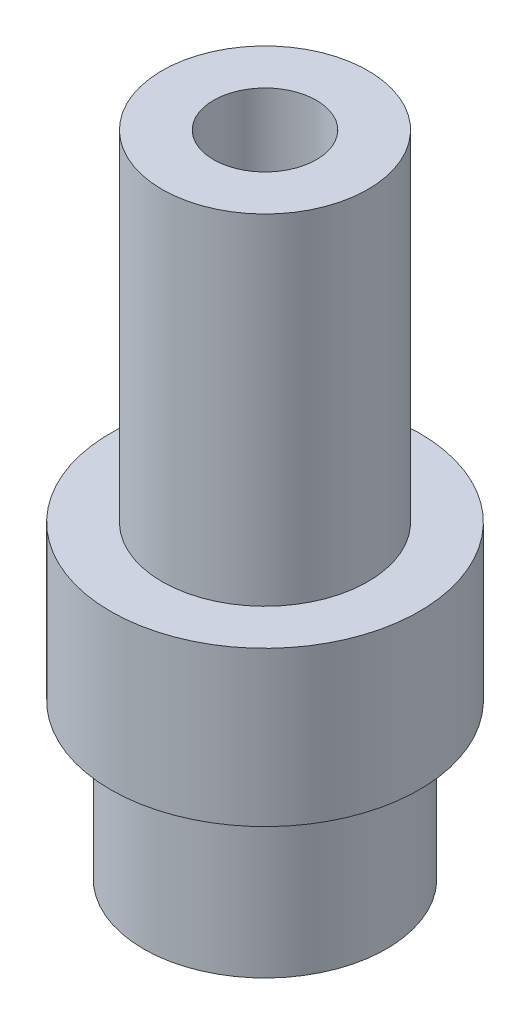
ISO-10303-21;
HEADER;
FILE_DESCRIPTION(('STEP AP214'),'2;1');
FILE_NAME('part.step','',(''),(''),'','','');
FILE_SCHEMA(('AUTOMOTIVE_DESIGN { 1 0 10303 214 1 1 1 1 }'));
ENDSEC;
DATA;
#1=APPLICATION_CONTEXT('core data for automotive mechanical design processes');
#2=APPLICATION_PROTOCOL_DEFINITION('international standard','automotive_design',2000,#1);
#3=PRODUCT_CONTEXT('',#1,'mechanical');
#4=PRODUCT('Part','Part','',(#3));
#5=PRODUCT_RELATED_PRODUCT_CATEGORY('part','',(#4));
#6=PRODUCT_DEFINITION_FORMATION('','',#4);
#7=PRODUCT_DEFINITION_CONTEXT('part definition',#1,'design');
#8=PRODUCT_DEFINITION('design','',#6,#7);
#9=PRODUCT_DEFINITION_SHAPE('','',#8);
#10=(LENGTH_UNIT() NAMED_UNIT(*) SI_UNIT(.MILLI.,.METRE.));
#11=(NAMED_UNIT(*) PLANE_ANGLE_UNIT() SI_UNIT($,.RADIAN.));
#12=(NAMED_UNIT(*) SI_UNIT($,.STERADIAN.) SOLID_ANGLE_UNIT());
#13=UNCERTAINTY_MEASURE_WITH_UNIT(LENGTH_MEASURE(1.E-05),#10,'distance_accuracy_value','');
#14=(GEOMETRIC_REPRESENTATION_CONTEXT(3) GLOBAL_UNCERTAINTY_ASSIGNED_CONTEXT((#13)) GLOBAL_UNIT_ASSIGNED_CONTEXT((#10,
#11,#12)) REPRESENTATION_CONTEXT('',''));
#15=CARTESIAN_POINT('',(0.,0.,0.));
#16=DIRECTION('',(0.,0.,1.));
#17=DIRECTION('',(1.,0.,0.));
#18=AXIS2_PLACEMENT_3D('',#15,#16,#17);
#19=CARTESIAN_POINT('',(0.,0.,0.));
#20=DIRECTION('',(0.,1.,0.));
#21=DIRECTION('',(0.,0.,1.));
#22=AXIS2_PLACEMENT_3D('',#19,#20,#21);
#23=CYLINDRICAL_SURFACE('',#22,3.175);
#24=CARTESIAN_POINT('',(0.,0.,0.));
#25=DIRECTION('',(0.,1.,0.));
#26=DIRECTION('',(0.,0.,1.));
#27=AXIS2_PLACEMENT_3D('',#24,#25,#26);
#28=CIRCLE('',#27,3.175);
#29=CARTESIAN_POINT('',(0.,0.,3.175));
#30=VERTEX_POINT('',#29);
#31=EDGE_CURVE('E10',#30,#30,#28,.T.);
#32=ORIENTED_EDGE('',*,*,#31,.T.);
#33=EDGE_LOOP('',(#32));
#34=FACE_BOUND('',#33,.T.);
#35=CARTESIAN_POINT('',(0.,-27.305,0.));
#36=DIRECTION('',(0.,1.,0.));
#37=DIRECTION('',(0.,0.,1.));
#38=AXIS2_PLACEMENT_3D('',#35,#36,#37);
#39=CIRCLE('',#38,3.175);
#40=CARTESIAN_POINT('',(0.,-27.305,3.175));
#41=VERTEX_POINT('',#40);
#42=EDGE_CURVE('E80',#41,#41,#39,.T.);
#43=ORIENTED_EDGE('',*,*,#42,.F.);
#44=EDGE_LOOP('',(#43));
#45=FACE_BOUND('',#44,.T.);
#46=ADVANCED_FACE('F37',(#34,#45),#23,.F.);
#47=CARTESIAN_POINT('',(-3.175,0.,0.));
#48=DIRECTION('',(0.,1.,0.));
#49=DIRECTION('',(0.,0.,1.));
#50=AXIS2_PLACEMENT_3D('',#47,#48,#49);
#51=PLANE('',#50);
#52=CARTESIAN_POINT('',(0.,0.,0.));
#53=DIRECTION('',(0.,1.,0.));
#54=DIRECTION('',(0.,0.,1.));
#55=AXIS2_PLACEMENT_3D('',#52,#53,#54);
#56=CIRCLE('',#55,6.35);
#57=CARTESIAN_POINT('',(0.,0.,6.35));
#58=VERTEX_POINT('',#57);
#59=EDGE_CURVE('E44',#58,#58,#56,.T.);
#60=ORIENTED_EDGE('',*,*,#59,.T.);
#61=EDGE_LOOP('',(#60));
#62=FACE_BOUND('',#61,.T.);
#63=ORIENTED_EDGE('',*,*,#31,.F.);
#64=EDGE_LOOP('',(#63));
#65=FACE_BOUND('',#64,.T.);
#66=ADVANCED_FACE('F89',(#62,#65),#51,.T.);
#67=CARTESIAN_POINT('',(0.,0.,0.));
#68=DIRECTION('',(0.,1.,0.));
#69=DIRECTION('',(0.,0.,1.));
#70=AXIS2_PLACEMENT_3D('',#67,#68,#69);
#71=CYLINDRICAL_SURFACE('',#70,6.35);
#72=CARTESIAN_POINT('',(0.,-20.955,0.));
#73=DIRECTION('',(0.,1.,0.));
#74=DIRECTION('',(0.,0.,1.));
#75=AXIS2_PLACEMENT_3D('',#72,#73,#74);
#76=CIRCLE('',#75,6.35);
#77=CARTESIAN_POINT('',(0.,-20.955,6.35));
#78=VERTEX_POINT('',#77);
#79=EDGE_CURVE('E49',#78,#78,#76,.T.);
#80=ORIENTED_EDGE('',*,*,#79,.T.);
#81=EDGE_LOOP('',(#80));
#82=FACE_BOUND('',#81,.T.);
#83=ORIENTED_EDGE('',*,*,#59,.F.);
#84=EDGE_LOOP('',(#83));
#85=FACE_BOUND('',#84,.T.);
#86=ADVANCED_FACE('F93',(#82,#85),#71,.T.);
#87=CARTESIAN_POINT('',(-6.35,-20.955,0.));
#88=DIRECTION('',(0.,1.,0.));
#89=DIRECTION('',(0.,0.,1.));
#90=AXIS2_PLACEMENT_3D('',#87,#88,#89);
#91=PLANE('',#90);
#92=CARTESIAN_POINT('',(0.,-20.955,0.));
#93=DIRECTION('',(0.,1.,0.));
#94=DIRECTION('',(0.,0.,1.));
#95=AXIS2_PLACEMENT_3D('',#92,#93,#94);
#96=CIRCLE('',#95,9.525);
#97=CARTESIAN_POINT('',(0.,-20.955,9.525));
#98=VERTEX_POINT('',#97);
#99=EDGE_CURVE('E54',#98,#98,#96,.T.);
#100=ORIENTED_EDGE('',*,*,#99,.T.);
#101=EDGE_LOOP('',(#100));
#102=FACE_BOUND('',#101,.T.);
#103=ORIENTED_EDGE('',*,*,#79,.F.);
#104=EDGE_LOOP('',(#103));
#105=FACE_BOUND('',#104,.T.);
#106=ADVANCED_FACE('F97',(#102,#105),#91,.T.);
#107=CARTESIAN_POINT('',(0.,0.,0.));
#108=DIRECTION('',(0.,1.,0.));
#109=DIRECTION('',(0.,0.,1.));
#110=AXIS2_PLACEMENT_3D('',#107,#108,#109);
#111=CYLINDRICAL_SURFACE('',#110,9.525);
#112=CARTESIAN_POINT('',(0.,-30.48,0.));
#113=DIRECTION('',(0.,1.,0.));
#114=DIRECTION('',(0.,0.,1.));
#115=AXIS2_PLACEMENT_3D('',#112,#113,#114);
#116=CIRCLE('',#115,9.525);
#117=CARTESIAN_POINT('',(0.,-30.48,9.525));
#118=VERTEX_POINT('',#117);
#119=EDGE_CURVE('E60',#118,#118,#116,.T.);
#120=ORIENTED_EDGE('',*,*,#119,.T.);
#121=EDGE_LOOP('',(#120));
#122=FACE_BOUND('',#121,.T.);
#123=ORIENTED_EDGE('',*,*,#99,.F.);
#124=EDGE_LOOP('',(#123));
#125=FACE_BOUND('',#124,.T.);
#126=ADVANCED_FACE('F104',(#122,#125),#111,.T.);
#127=CARTESIAN_POINT('',(-9.525,-30.48,0.));
#128=DIRECTION('',(0.,-1.,0.));
#129=DIRECTION('',(0.,0.,-1.));
#130=AXIS2_PLACEMENT_3D('',#127,#128,#129);
#131=PLANE('',#130);
#132=CARTESIAN_POINT('',(0.,-30.48,0.));
#133=DIRECTION('',(0.,1.,0.));
#134=DIRECTION('',(0.,0.,1.));
#135=AXIS2_PLACEMENT_3D('',#132,#133,#134);
#136=CIRCLE('',#135,7.49299999999999);
#137=CARTESIAN_POINT('',(0.,-30.48,7.49299999999999));
#138=VERTEX_POINT('',#137);
#139=EDGE_CURVE('E64',#138,#138,#136,.T.);
#140=ORIENTED_EDGE('',*,*,#139,.T.);
#141=EDGE_LOOP('',(#140));
#142=FACE_BOUND('',#141,.T.);
#143=ORIENTED_EDGE('',*,*,#119,.F.);
#144=EDGE_LOOP('',(#143));
#145=FACE_BOUND('',#144,.T.);
#146=ADVANCED_FACE('F108',(#142,#145),#131,.T.);
#147=CARTESIAN_POINT('',(0.,0.,0.));
#148=DIRECTION('',(0.,1.,0.));
#149=DIRECTION('',(0.,0.,1.));
#150=AXIS2_PLACEMENT_3D('',#147,#148,#149);
#151=CYLINDRICAL_SURFACE('',#150,7.49299999999999);
#152=CARTESIAN_POINT('',(0.,-40.005,0.));
#153=DIRECTION('',(0.,1.,0.));
#154=DIRECTION('',(0.,0.,1.));
#155=AXIS2_PLACEMENT_3D('',#152,#153,#154);
#156=CIRCLE('',#155,7.49299999999999);
#157=CARTESIAN_POINT('',(0.,-40.005,7.49299999999999));
#158=VERTEX_POINT('',#157);
#159=EDGE_CURVE('E68',#158,#158,#156,.T.);
#160=ORIENTED_EDGE('',*,*,#159,.T.);
#161=EDGE_LOOP('',(#160));
#162=FACE_BOUND('',#161,.T.);
#163=ORIENTED_EDGE('',*,*,#139,.F.);
#164=EDGE_LOOP('',(#163));
#165=FACE_BOUND('',#164,.T.);
#166=ADVANCED_FACE('F112',(#162,#165),#151,.T.);
#167=CARTESIAN_POINT('',(-7.49299999999999,-40.005,0.));
#168=DIRECTION('',(0.,-1.,0.));
#169=DIRECTION('',(0.,0.,-1.));
#170=AXIS2_PLACEMENT_3D('',#167,#168,#169);
#171=PLANE('',#170);
#172=CARTESIAN_POINT('',(0.,-40.005,0.));
#173=DIRECTION('',(0.,1.,0.));
#174=DIRECTION('',(0.,0.,1.));
#175=AXIS2_PLACEMENT_3D('',#172,#173,#174);
#176=CIRCLE('',#175,5.207);
#177=CARTESIAN_POINT('',(0.,-40.005,5.207));
#178=VERTEX_POINT('',#177);
#179=EDGE_CURVE('E72',#178,#178,#176,.T.);
#180=ORIENTED_EDGE('',*,*,#179,.T.);
#181=EDGE_LOOP('',(#180));
#182=FACE_BOUND('',#181,.T.);
#183=ORIENTED_EDGE('',*,*,#159,.F.);
#184=EDGE_LOOP('',(#183));
#185=FACE_BOUND('',#184,.T.);
#186=ADVANCED_FACE('F116',(#182,#185),#171,.T.);
#187=CARTESIAN_POINT('',(0.,0.,0.));
#188=DIRECTION('',(0.,1.,0.));
#189=DIRECTION('',(0.,0.,1.));
#190=AXIS2_PLACEMENT_3D('',#187,#188,#189);
#191=CYLINDRICAL_SURFACE('',#190,5.207);
#192=CARTESIAN_POINT('',(0.,-27.305,0.));
#193=DIRECTION('',(0.,1.,0.));
#194=DIRECTION('',(0.,0.,1.));
#195=AXIS2_PLACEMENT_3D('',#192,#193,#194);
#196=CIRCLE('',#195,5.207);
#197=CARTESIAN_POINT('',(0.,-27.305,5.207));
#198=VERTEX_POINT('',#197);
#199=EDGE_CURVE('E76',#198,#198,#196,.T.);
#200=ORIENTED_EDGE('',*,*,#199,.T.);
#201=EDGE_LOOP('',(#200));
#202=FACE_BOUND('',#201,.T.);
#203=ORIENTED_EDGE('',*,*,#179,.F.);
#204=EDGE_LOOP('',(#203));
#205=FACE_BOUND('',#204,.T.);
#206=ADVANCED_FACE('F120',(#202,#205),#191,.F.);
#207=CARTESIAN_POINT('',(-5.207,-27.305,0.));
#208=DIRECTION('',(0.,-1.,0.));
#209=DIRECTION('',(0.,0.,-1.));
#210=AXIS2_PLACEMENT_3D('',#207,#208,#209);
#211=PLANE('',#210);
#212=ORIENTED_EDGE('',*,*,#42,.T.);
#213=EDGE_LOOP('',(#212));
#214=FACE_BOUND('',#213,.T.);
#215=ORIENTED_EDGE('',*,*,#199,.F.);
#216=EDGE_LOOP('',(#215));
#217=FACE_BOUND('',#216,.T.);
#218=ADVANCED_FACE('F85',(#214,#217),#211,.T.);
#219=CLOSED_SHELL('',(#46,#66,#86,#106,#126,#146,#166,#186,#206,#218));
#220=MANIFOLD_SOLID_BREP('B2',#219);
#221=ADVANCED_BREP_SHAPE_REPRESENTATION('',(#18,#220),#14);
#222=SHAPE_DEFINITION_REPRESENTATION(#9,#221);
ENDSEC;
END-ISO-10303-21;
